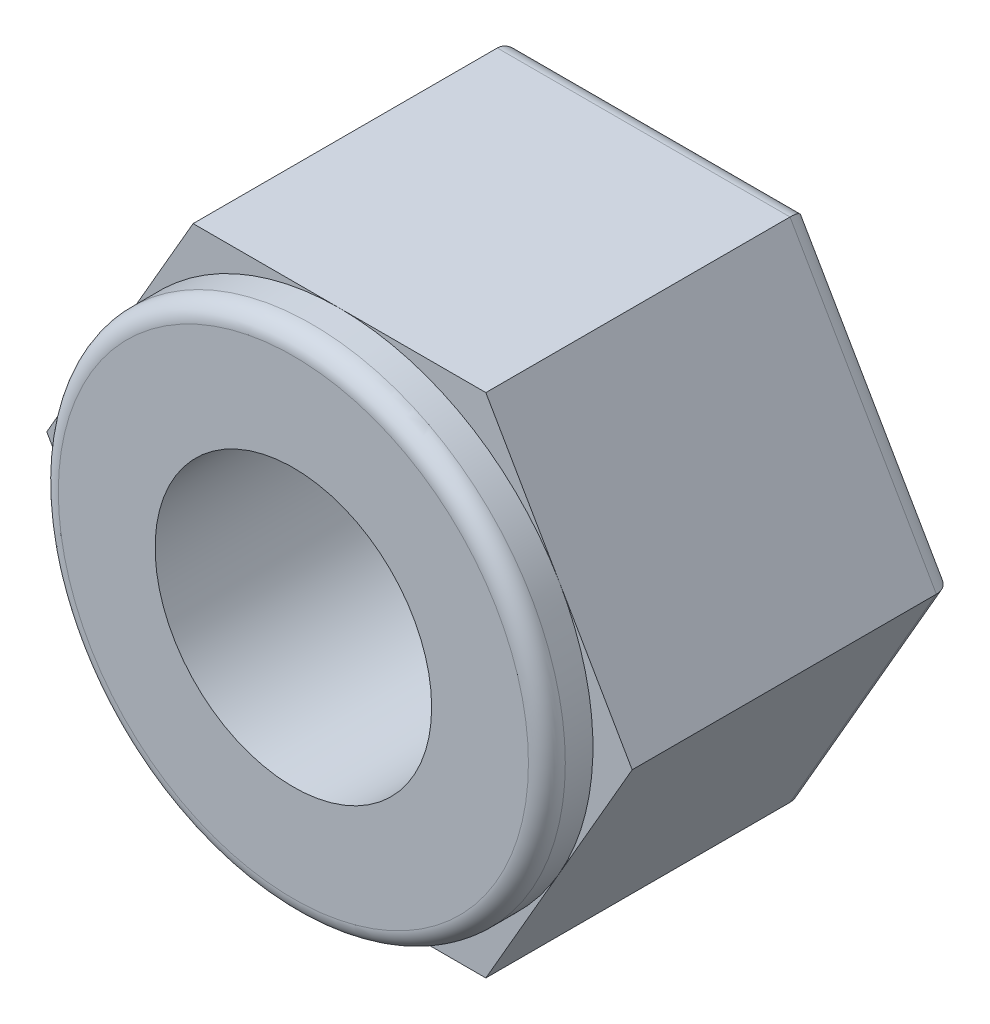
ISO-10303-21;
HEADER;
FILE_DESCRIPTION(('STEP AP214'),'2;1');
FILE_NAME('part.step','',(''),(''),'','','');
FILE_SCHEMA(('AUTOMOTIVE_DESIGN { 1 0 10303 214 1 1 1 1 }'));
ENDSEC;
DATA;
#1=APPLICATION_CONTEXT('core data for automotive mechanical design processes');
#2=APPLICATION_PROTOCOL_DEFINITION('international standard','automotive_design',2000,#1);
#3=PRODUCT_CONTEXT('',#1,'mechanical');
#4=PRODUCT('Part','Part','',(#3));
#5=PRODUCT_RELATED_PRODUCT_CATEGORY('part','',(#4));
#6=PRODUCT_DEFINITION_FORMATION('','',#4);
#7=PRODUCT_DEFINITION_CONTEXT('part definition',#1,'design');
#8=PRODUCT_DEFINITION('design','',#6,#7);
#9=PRODUCT_DEFINITION_SHAPE('','',#8);
#10=(LENGTH_UNIT() NAMED_UNIT(*) SI_UNIT(.MILLI.,.METRE.));
#11=(NAMED_UNIT(*) PLANE_ANGLE_UNIT() SI_UNIT($,.RADIAN.));
#12=(NAMED_UNIT(*) SI_UNIT($,.STERADIAN.) SOLID_ANGLE_UNIT());
#13=UNCERTAINTY_MEASURE_WITH_UNIT(LENGTH_MEASURE(1.E-05),#10,'distance_accuracy_value','');
#14=(GEOMETRIC_REPRESENTATION_CONTEXT(3) GLOBAL_UNCERTAINTY_ASSIGNED_CONTEXT((#13)) GLOBAL_UNIT_ASSIGNED_CONTEXT((#10,
#11,#12)) REPRESENTATION_CONTEXT('',''));
#15=CARTESIAN_POINT('',(0.,0.,0.));
#16=DIRECTION('',(0.,0.,1.));
#17=DIRECTION('',(1.,0.,0.));
#18=AXIS2_PLACEMENT_3D('',#15,#16,#17);
#19=CARTESIAN_POINT('',(0.,0.,3.5));
#20=DIRECTION('',(0.,0.,1.));
#21=DIRECTION('',(1.,0.,0.));
#22=AXIS2_PLACEMENT_3D('',#19,#20,#21);
#23=PLANE('',#22);
#24=CARTESIAN_POINT('',(0.,0.,3.5));
#25=DIRECTION('',(0.,0.,1.));
#26=DIRECTION('',(1.,0.,0.));
#27=AXIS2_PLACEMENT_3D('',#24,#25,#26);
#28=CIRCLE('',#27,2.75);
#29=CARTESIAN_POINT('',(2.38156986040721,1.375,3.5));
#30=VERTEX_POINT('',#29);
#31=CARTESIAN_POINT('',(0.,2.75,3.5));
#32=VERTEX_POINT('',#31);
#33=EDGE_CURVE('E157',#30,#32,#28,.T.);
#34=ORIENTED_EDGE('',*,*,#33,.F.);
#35=DIRECTION('',(-0.5,0.866025403784438,0.));
#36=VECTOR('',#35,1.);
#37=CARTESIAN_POINT('',(3.17542648054294,0.,3.5));
#38=LINE('',#37,#36);
#39=CARTESIAN_POINT('',(1.58771324027147,2.75,3.5));
#40=VERTEX_POINT('',#39);
#41=EDGE_CURVE('E144',#30,#40,#38,.T.);
#42=ORIENTED_EDGE('',*,*,#41,.T.);
#43=DIRECTION('',(-1.,0.,0.));
#44=VECTOR('',#43,1.);
#45=CARTESIAN_POINT('',(1.58771324027147,2.75,3.5));
#46=LINE('',#45,#44);
#47=EDGE_CURVE('E158',#40,#32,#46,.T.);
#48=ORIENTED_EDGE('',*,*,#47,.T.);
#49=EDGE_LOOP('',(#34,#42,#48));
#50=FACE_BOUND('',#49,.T.);
#51=ADVANCED_FACE('F43',(#50),#23,.T.);
#52=CARTESIAN_POINT('',(-2.38156986040721,1.375,3.5));
#53=VERTEX_POINT('',#52);
#54=EDGE_CURVE('E165',#32,#53,#28,.T.);
#55=ORIENTED_EDGE('',*,*,#54,.F.);
#56=CARTESIAN_POINT('',(-1.58771324027147,2.75,3.5));
#57=VERTEX_POINT('',#56);
#58=EDGE_CURVE('E143',#32,#57,#46,.T.);
#59=ORIENTED_EDGE('',*,*,#58,.T.);
#60=DIRECTION('',(-0.5,-0.866025403784439,0.));
#61=VECTOR('',#60,1.);
#62=CARTESIAN_POINT('',(-1.58771324027147,2.75,3.5));
#63=LINE('',#62,#61);
#64=EDGE_CURVE('E187',#57,#53,#63,.T.);
#65=ORIENTED_EDGE('',*,*,#64,.T.);
#66=EDGE_LOOP('',(#55,#59,#65));
#67=FACE_BOUND('',#66,.T.);
#68=ADVANCED_FACE('F305',(#67),#23,.T.);
#69=CARTESIAN_POINT('',(-2.3815698604072,-1.375,3.5));
#70=VERTEX_POINT('',#69);
#71=EDGE_CURVE('E335',#53,#70,#28,.T.);
#72=ORIENTED_EDGE('',*,*,#71,.F.);
#73=CARTESIAN_POINT('',(-3.17542648054294,0.,3.5));
#74=VERTEX_POINT('',#73);
#75=EDGE_CURVE('E186',#53,#74,#63,.T.);
#76=ORIENTED_EDGE('',*,*,#75,.T.);
#77=DIRECTION('',(0.5,-0.866025403784438,0.));
#78=VECTOR('',#77,1.);
#79=CARTESIAN_POINT('',(-3.17542648054294,0.,3.5));
#80=LINE('',#79,#78);
#81=EDGE_CURVE('E192',#74,#70,#80,.T.);
#82=ORIENTED_EDGE('',*,*,#81,.T.);
#83=EDGE_LOOP('',(#72,#76,#82));
#84=FACE_BOUND('',#83,.T.);
#85=ADVANCED_FACE('F310',(#84),#23,.T.);
#86=CARTESIAN_POINT('',(0.,-2.75,3.5));
#87=VERTEX_POINT('',#86);
#88=EDGE_CURVE('E174',#70,#87,#28,.T.);
#89=ORIENTED_EDGE('',*,*,#88,.F.);
#90=CARTESIAN_POINT('',(-1.58771324027147,-2.75,3.5));
#91=VERTEX_POINT('',#90);
#92=EDGE_CURVE('E191',#70,#91,#80,.T.);
#93=ORIENTED_EDGE('',*,*,#92,.T.);
#94=DIRECTION('',(1.,0.,0.));
#95=VECTOR('',#94,1.);
#96=CARTESIAN_POINT('',(-1.58771324027147,-2.75,3.5));
#97=LINE('',#96,#95);
#98=EDGE_CURVE('E197',#91,#87,#97,.T.);
#99=ORIENTED_EDGE('',*,*,#98,.T.);
#100=EDGE_LOOP('',(#89,#93,#99));
#101=FACE_BOUND('',#100,.T.);
#102=ADVANCED_FACE('F322',(#101),#23,.T.);
#103=CARTESIAN_POINT('',(2.38156986040721,-1.375,3.5));
#104=VERTEX_POINT('',#103);
#105=EDGE_CURVE('E169',#87,#104,#28,.T.);
#106=ORIENTED_EDGE('',*,*,#105,.F.);
#107=CARTESIAN_POINT('',(1.58771324027148,-2.75,3.5));
#108=VERTEX_POINT('',#107);
#109=EDGE_CURVE('E196',#87,#108,#97,.T.);
#110=ORIENTED_EDGE('',*,*,#109,.T.);
#111=DIRECTION('',(0.5,0.866025403784439,0.));
#112=VECTOR('',#111,1.);
#113=CARTESIAN_POINT('',(1.58771324027148,-2.75,3.5));
#114=LINE('',#113,#112);
#115=EDGE_CURVE('E155',#108,#104,#114,.T.);
#116=ORIENTED_EDGE('',*,*,#115,.T.);
#117=EDGE_LOOP('',(#106,#110,#116));
#118=FACE_BOUND('',#117,.T.);
#119=ADVANCED_FACE('F315',(#118),#23,.T.);
#120=EDGE_CURVE('E138',#104,#30,#28,.T.);
#121=ORIENTED_EDGE('',*,*,#120,.F.);
#122=CARTESIAN_POINT('',(3.17542648054294,0.,3.5));
#123=VERTEX_POINT('',#122);
#124=EDGE_CURVE('E140',#104,#123,#114,.T.);
#125=ORIENTED_EDGE('',*,*,#124,.T.);
#126=EDGE_CURVE('E134',#123,#30,#38,.T.);
#127=ORIENTED_EDGE('',*,*,#126,.T.);
#128=EDGE_LOOP('',(#121,#125,#127));
#129=FACE_BOUND('',#128,.T.);
#130=ADVANCED_FACE('F136',(#129),#23,.T.);
#131=CARTESIAN_POINT('',(0.,0.,0.));
#132=DIRECTION('',(0.,0.,1.));
#133=DIRECTION('',(1.,0.,0.));
#134=AXIS2_PLACEMENT_3D('',#131,#132,#133);
#135=PLANE('',#134);
#136=DIRECTION('',(1.,0.,0.));
#137=VECTOR('',#136,1.);
#138=CARTESIAN_POINT('',(0.,-2.55,0.));
#139=LINE('',#138,#137);
#140=CARTESIAN_POINT('',(1.47224318643355,-2.55,0.));
#141=VERTEX_POINT('',#140);
#142=CARTESIAN_POINT('',(-1.47224318643354,-2.55,0.));
#143=VERTEX_POINT('',#142);
#144=EDGE_CURVE('E229',#141,#143,#139,.F.);
#145=ORIENTED_EDGE('',*,*,#144,.T.);
#146=DIRECTION('',(0.5,-0.866025403784439,0.));
#147=VECTOR('',#146,1.);
#148=CARTESIAN_POINT('',(-2.20836477965032,-1.275,0.));
#149=LINE('',#148,#147);
#150=CARTESIAN_POINT('',(-2.94448637286709,0.,0.));
#151=VERTEX_POINT('',#150);
#152=EDGE_CURVE('E244',#143,#151,#149,.F.);
#153=ORIENTED_EDGE('',*,*,#152,.T.);
#154=DIRECTION('',(-0.5,-0.866025403784439,0.));
#155=VECTOR('',#154,1.);
#156=CARTESIAN_POINT('',(-2.20836477965032,1.275,0.));
#157=LINE('',#156,#155);
#158=CARTESIAN_POINT('',(-1.47224318643355,2.55,0.));
#159=VERTEX_POINT('',#158);
#160=EDGE_CURVE('E241',#151,#159,#157,.F.);
#161=ORIENTED_EDGE('',*,*,#160,.T.);
#162=DIRECTION('',(-1.,0.,0.));
#163=VECTOR('',#162,1.);
#164=CARTESIAN_POINT('',(0.,2.55,0.));
#165=LINE('',#164,#163);
#166=CARTESIAN_POINT('',(1.47224318643355,2.55,0.));
#167=VERTEX_POINT('',#166);
#168=EDGE_CURVE('E238',#159,#167,#165,.F.);
#169=ORIENTED_EDGE('',*,*,#168,.T.);
#170=DIRECTION('',(-0.5,0.866025403784439,0.));
#171=VECTOR('',#170,1.);
#172=CARTESIAN_POINT('',(2.20836477965032,1.275,0.));
#173=LINE('',#172,#171);
#174=CARTESIAN_POINT('',(2.94448637286709,0.,0.));
#175=VERTEX_POINT('',#174);
#176=EDGE_CURVE('E235',#167,#175,#173,.F.);
#177=ORIENTED_EDGE('',*,*,#176,.T.);
#178=DIRECTION('',(0.5,0.866025403784439,0.));
#179=VECTOR('',#178,1.);
#180=CARTESIAN_POINT('',(2.20836477965032,-1.275,0.));
#181=LINE('',#180,#179);
#182=EDGE_CURVE('E232',#175,#141,#181,.F.);
#183=ORIENTED_EDGE('',*,*,#182,.T.);
#184=EDGE_LOOP('',(#145,#153,#161,#169,#177,#183));
#185=FACE_BOUND('',#184,.T.);
#186=CARTESIAN_POINT('',(0.,0.,0.));
#187=DIRECTION('',(0.,0.,1.));
#188=DIRECTION('',(1.,0.,0.));
#189=AXIS2_PLACEMENT_3D('',#186,#187,#188);
#190=CIRCLE('',#189,1.5);
#191=CARTESIAN_POINT('',(1.5,0.,0.));
#192=VERTEX_POINT('',#191);
#193=EDGE_CURVE('E162',#192,#192,#190,.T.);
#194=ORIENTED_EDGE('',*,*,#193,.T.);
#195=EDGE_LOOP('',(#194));
#196=FACE_BOUND('',#195,.T.);
#197=ADVANCED_FACE('F314',(#185,#196),#135,.F.);
#198=CARTESIAN_POINT('',(1.58771324027148,-2.75,3.5));
#199=DIRECTION('',(-0.866025403784439,0.5,0.));
#200=DIRECTION('',(-0.5,-0.866025403784439,0.));
#201=AXIS2_PLACEMENT_3D('',#198,#199,#200);
#202=PLANE('',#201);
#203=DIRECTION('',(0.,0.,-1.));
#204=VECTOR('',#203,1.);
#205=CARTESIAN_POINT('',(1.58771324027148,-2.75,3.5));
#206=LINE('',#205,#204);
#207=CARTESIAN_POINT('',(1.58771324027148,-2.75,0.2));
#208=VERTEX_POINT('',#207);
#209=EDGE_CURVE('E201',#108,#208,#206,.T.);
#210=ORIENTED_EDGE('',*,*,#209,.T.);
#211=DIRECTION('',(0.5,0.866025403784439,0.));
#212=VECTOR('',#211,1.);
#213=CARTESIAN_POINT('',(1.58771324027148,-2.75,0.2));
#214=LINE('',#213,#212);
#215=CARTESIAN_POINT('',(3.17542648054294,0.,0.2));
#216=VERTEX_POINT('',#215);
#217=EDGE_CURVE('E53',#208,#216,#214,.T.);
#218=ORIENTED_EDGE('',*,*,#217,.T.);
#219=DIRECTION('',(0.,0.,-1.));
#220=VECTOR('',#219,1.);
#221=CARTESIAN_POINT('',(3.17542648054294,0.,3.5));
#222=LINE('',#221,#220);
#223=EDGE_CURVE('E171',#123,#216,#222,.T.);
#224=ORIENTED_EDGE('',*,*,#223,.F.);
#225=ORIENTED_EDGE('',*,*,#124,.F.);
#226=ORIENTED_EDGE('',*,*,#115,.F.);
#227=EDGE_LOOP('',(#210,#218,#224,#225,#226));
#228=FACE_BOUND('',#227,.T.);
#229=ADVANCED_FACE('F320',(#228),#202,.F.);
#230=CARTESIAN_POINT('',(3.17542648054294,0.,3.5));
#231=DIRECTION('',(-0.866025403784438,-0.5,0.));
#232=DIRECTION('',(0.5,-0.866025403784439,0.));
#233=AXIS2_PLACEMENT_3D('',#230,#231,#232);
#234=PLANE('',#233);
#235=ORIENTED_EDGE('',*,*,#223,.T.);
#236=DIRECTION('',(-0.5,0.866025403784439,0.));
#237=VECTOR('',#236,1.);
#238=CARTESIAN_POINT('',(3.17542648054294,0.,0.2));
#239=LINE('',#238,#237);
#240=CARTESIAN_POINT('',(1.58771324027147,2.75,0.2));
#241=VERTEX_POINT('',#240);
#242=EDGE_CURVE('E254',#216,#241,#239,.T.);
#243=ORIENTED_EDGE('',*,*,#242,.T.);
#244=DIRECTION('',(0.,0.,-1.));
#245=VECTOR('',#244,1.);
#246=CARTESIAN_POINT('',(1.58771324027147,2.75,3.5));
#247=LINE('',#246,#245);
#248=EDGE_CURVE('E150',#40,#241,#247,.T.);
#249=ORIENTED_EDGE('',*,*,#248,.F.);
#250=ORIENTED_EDGE('',*,*,#41,.F.);
#251=ORIENTED_EDGE('',*,*,#126,.F.);
#252=EDGE_LOOP('',(#235,#243,#249,#250,#251));
#253=FACE_BOUND('',#252,.T.);
#254=ADVANCED_FACE('F148',(#253),#234,.F.);
#255=CARTESIAN_POINT('',(1.58771324027147,2.75,3.5));
#256=DIRECTION('',(0.,-1.,0.));
#257=DIRECTION('',(0.,0.,-1.));
#258=AXIS2_PLACEMENT_3D('',#255,#256,#257);
#259=PLANE('',#258);
#260=ORIENTED_EDGE('',*,*,#248,.T.);
#261=DIRECTION('',(-1.,0.,0.));
#262=VECTOR('',#261,1.);
#263=CARTESIAN_POINT('',(1.58771324027147,2.75,0.2));
#264=LINE('',#263,#262);
#265=CARTESIAN_POINT('',(-1.58771324027147,2.75,0.2));
#266=VERTEX_POINT('',#265);
#267=EDGE_CURVE('E251',#241,#266,#264,.T.);
#268=ORIENTED_EDGE('',*,*,#267,.T.);
#269=DIRECTION('',(0.,0.,-1.));
#270=VECTOR('',#269,1.);
#271=CARTESIAN_POINT('',(-1.58771324027147,2.75,3.5));
#272=LINE('',#271,#270);
#273=EDGE_CURVE('E211',#57,#266,#272,.T.);
#274=ORIENTED_EDGE('',*,*,#273,.F.);
#275=ORIENTED_EDGE('',*,*,#58,.F.);
#276=ORIENTED_EDGE('',*,*,#47,.F.);
#277=EDGE_LOOP('',(#260,#268,#274,#275,#276));
#278=FACE_BOUND('',#277,.T.);
#279=ADVANCED_FACE('F343',(#278),#259,.F.);
#280=CARTESIAN_POINT('',(-1.58771324027147,2.75,3.5));
#281=DIRECTION('',(0.866025403784439,-0.5,0.));
#282=DIRECTION('',(0.5,0.866025403784439,0.));
#283=AXIS2_PLACEMENT_3D('',#280,#281,#282);
#284=PLANE('',#283);
#285=ORIENTED_EDGE('',*,*,#273,.T.);
#286=DIRECTION('',(-0.5,-0.866025403784439,0.));
#287=VECTOR('',#286,1.);
#288=CARTESIAN_POINT('',(-1.58771324027147,2.75,0.2));
#289=LINE('',#288,#287);
#290=CARTESIAN_POINT('',(-3.17542648054294,0.,0.2));
#291=VERTEX_POINT('',#290);
#292=EDGE_CURVE('E248',#266,#291,#289,.T.);
#293=ORIENTED_EDGE('',*,*,#292,.T.);
#294=DIRECTION('',(0.,0.,-1.));
#295=VECTOR('',#294,1.);
#296=CARTESIAN_POINT('',(-3.17542648054294,0.,3.5));
#297=LINE('',#296,#295);
#298=EDGE_CURVE('E207',#74,#291,#297,.T.);
#299=ORIENTED_EDGE('',*,*,#298,.F.);
#300=ORIENTED_EDGE('',*,*,#75,.F.);
#301=ORIENTED_EDGE('',*,*,#64,.F.);
#302=EDGE_LOOP('',(#285,#293,#299,#300,#301));
#303=FACE_BOUND('',#302,.T.);
#304=ADVANCED_FACE('F353',(#303),#284,.F.);
#305=CARTESIAN_POINT('',(-3.17542648054294,0.,3.5));
#306=DIRECTION('',(0.866025403784438,0.5,0.));
#307=DIRECTION('',(-0.5,0.866025403784439,0.));
#308=AXIS2_PLACEMENT_3D('',#305,#306,#307);
#309=PLANE('',#308);
#310=ORIENTED_EDGE('',*,*,#298,.T.);
#311=DIRECTION('',(0.5,-0.866025403784439,0.));
#312=VECTOR('',#311,1.);
#313=CARTESIAN_POINT('',(-3.17542648054294,0.,0.2));
#314=LINE('',#313,#312);
#315=CARTESIAN_POINT('',(-1.58771324027147,-2.75,0.2));
#316=VERTEX_POINT('',#315);
#317=EDGE_CURVE('E225',#291,#316,#314,.T.);
#318=ORIENTED_EDGE('',*,*,#317,.T.);
#319=DIRECTION('',(0.,0.,-1.));
#320=VECTOR('',#319,1.);
#321=CARTESIAN_POINT('',(-1.58771324027147,-2.75,3.5));
#322=LINE('',#321,#320);
#323=EDGE_CURVE('E204',#91,#316,#322,.T.);
#324=ORIENTED_EDGE('',*,*,#323,.F.);
#325=ORIENTED_EDGE('',*,*,#92,.F.);
#326=ORIENTED_EDGE('',*,*,#81,.F.);
#327=EDGE_LOOP('',(#310,#318,#324,#325,#326));
#328=FACE_BOUND('',#327,.T.);
#329=ADVANCED_FACE('F357',(#328),#309,.F.);
#330=CARTESIAN_POINT('',(-1.58771324027147,-2.75,3.5));
#331=DIRECTION('',(0.,1.,0.));
#332=DIRECTION('',(0.,0.,1.));
#333=AXIS2_PLACEMENT_3D('',#330,#331,#332);
#334=PLANE('',#333);
#335=ORIENTED_EDGE('',*,*,#323,.T.);
#336=DIRECTION('',(1.,0.,0.));
#337=VECTOR('',#336,1.);
#338=CARTESIAN_POINT('',(-1.58771324027147,-2.75,0.2));
#339=LINE('',#338,#337);
#340=EDGE_CURVE('E11',#316,#208,#339,.T.);
#341=ORIENTED_EDGE('',*,*,#340,.T.);
#342=ORIENTED_EDGE('',*,*,#209,.F.);
#343=ORIENTED_EDGE('',*,*,#109,.F.);
#344=ORIENTED_EDGE('',*,*,#98,.F.);
#345=EDGE_LOOP('',(#335,#341,#342,#343,#344));
#346=FACE_BOUND('',#345,.T.);
#347=ADVANCED_FACE('F301',(#346),#334,.F.);
#348=CARTESIAN_POINT('',(0.,0.,3.5));
#349=DIRECTION('',(0.,0.,-1.));
#350=DIRECTION('',(-1.,0.,0.));
#351=AXIS2_PLACEMENT_3D('',#348,#349,#350);
#352=CYLINDRICAL_SURFACE('',#351,1.5);
#353=ORIENTED_EDGE('',*,*,#193,.F.);
#354=EDGE_LOOP('',(#353));
#355=FACE_BOUND('',#354,.T.);
#356=CARTESIAN_POINT('',(0.,0.,4.));
#357=DIRECTION('',(0.,0.,1.));
#358=DIRECTION('',(1.,0.,0.));
#359=AXIS2_PLACEMENT_3D('',#356,#357,#358);
#360=CIRCLE('',#359,1.5);
#361=CARTESIAN_POINT('',(1.5,0.,4.));
#362=VERTEX_POINT('',#361);
#363=EDGE_CURVE('E163',#362,#362,#360,.T.);
#364=ORIENTED_EDGE('',*,*,#363,.T.);
#365=EDGE_LOOP('',(#364));
#366=FACE_BOUND('',#365,.T.);
#367=ADVANCED_FACE('F288',(#355,#366),#352,.F.);
#368=CARTESIAN_POINT('',(0.,0.,4.));
#369=DIRECTION('',(0.,0.,1.));
#370=DIRECTION('',(1.,0.,0.));
#371=AXIS2_PLACEMENT_3D('',#368,#369,#370);
#372=PLANE('',#371);
#373=CARTESIAN_POINT('',(0.,0.,4.));
#374=DIRECTION('',(0.,0.,1.));
#375=DIRECTION('',(1.,0.,0.));
#376=AXIS2_PLACEMENT_3D('',#373,#374,#375);
#377=CIRCLE('',#376,2.55);
#378=CARTESIAN_POINT('',(2.55,0.,4.));
#379=VERTEX_POINT('',#378);
#380=EDGE_CURVE('E217',#379,#379,#377,.T.);
#381=ORIENTED_EDGE('',*,*,#380,.T.);
#382=EDGE_LOOP('',(#381));
#383=FACE_BOUND('',#382,.T.);
#384=ORIENTED_EDGE('',*,*,#363,.F.);
#385=EDGE_LOOP('',(#384));
#386=FACE_BOUND('',#385,.T.);
#387=ADVANCED_FACE('F290',(#383,#386),#372,.T.);
#388=CARTESIAN_POINT('',(0.,0.,4.));
#389=DIRECTION('',(0.,0.,-1.));
#390=DIRECTION('',(-1.,0.,0.));
#391=AXIS2_PLACEMENT_3D('',#388,#389,#390);
#392=CYLINDRICAL_SURFACE('',#391,2.75);
#393=CARTESIAN_POINT('',(0.,0.,3.8));
#394=DIRECTION('',(0.,0.,1.));
#395=DIRECTION('',(1.,0.,0.));
#396=AXIS2_PLACEMENT_3D('',#393,#394,#395);
#397=CIRCLE('',#396,2.75);
#398=CARTESIAN_POINT('',(2.75,0.,3.8));
#399=VERTEX_POINT('',#398);
#400=EDGE_CURVE('E221',#399,#399,#397,.F.);
#401=ORIENTED_EDGE('',*,*,#400,.T.);
#402=EDGE_LOOP('',(#401));
#403=FACE_BOUND('',#402,.T.);
#404=ORIENTED_EDGE('',*,*,#33,.T.);
#405=ORIENTED_EDGE('',*,*,#54,.T.);
#406=ORIENTED_EDGE('',*,*,#71,.T.);
#407=ORIENTED_EDGE('',*,*,#88,.T.);
#408=ORIENTED_EDGE('',*,*,#105,.T.);
#409=ORIENTED_EDGE('',*,*,#120,.T.);
#410=EDGE_LOOP('',(#404,#405,#406,#407,#408,#409));
#411=FACE_BOUND('',#410,.T.);
#412=ADVANCED_FACE('F167',(#403,#411),#392,.T.);
#413=CARTESIAN_POINT('',(0.,0.,3.8));
#414=DIRECTION('',(0.,0.,1.));
#415=DIRECTION('',(1.,0.,0.));
#416=AXIS2_PLACEMENT_3D('',#413,#414,#415);
#417=TOROIDAL_SURFACE('',#416,2.55,0.2);
#418=ORIENTED_EDGE('',*,*,#400,.F.);
#419=EDGE_LOOP('',(#418));
#420=FACE_BOUND('',#419,.T.);
#421=ORIENTED_EDGE('',*,*,#380,.F.);
#422=EDGE_LOOP('',(#421));
#423=FACE_BOUND('',#422,.T.);
#424=ADVANCED_FACE('F298',(#420,#423),#417,.T.);
#425=CARTESIAN_POINT('',(3.00222139978606,-0.100000000000002,0.2));
#426=DIRECTION('',(-0.5,0.866025403784439,0.));
#427=DIRECTION('',(-0.866025403784439,-0.5,0.));
#428=AXIS2_PLACEMENT_3D('',#425,#426,#427);
#429=CYLINDRICAL_SURFACE('',#428,0.2);
#430=CARTESIAN_POINT('',(2.94448637286709,0.,0.2));
#431=DIRECTION('',(0.,1.,0.));
#432=DIRECTION('',(1.,0.,0.));
#433=AXIS2_PLACEMENT_3D('',#430,#431,#432);
#434=ELLIPSE('',#433,0.23094010767585,0.2);
#435=EDGE_CURVE('E272',#175,#216,#434,.F.);
#436=ORIENTED_EDGE('',*,*,#435,.F.);
#437=ORIENTED_EDGE('',*,*,#176,.F.);
#438=CARTESIAN_POINT('',(1.47224318643355,2.55,0.2));
#439=DIRECTION('',(-0.866025403784439,0.5,0.));
#440=DIRECTION('',(0.5,0.866025403784439,0.));
#441=AXIS2_PLACEMENT_3D('',#438,#439,#440);
#442=ELLIPSE('',#441,0.23094010767585,0.2);
#443=EDGE_CURVE('E47',#241,#167,#442,.T.);
#444=ORIENTED_EDGE('',*,*,#443,.F.);
#445=ORIENTED_EDGE('',*,*,#242,.F.);
#446=EDGE_LOOP('',(#436,#437,#444,#445));
#447=FACE_BOUND('',#446,.T.);
#448=ADVANCED_FACE('F45',(#447),#429,.T.);
#449=CARTESIAN_POINT('',(1.58771324027147,2.55,0.2));
#450=DIRECTION('',(-1.,0.,0.));
#451=DIRECTION('',(0.,0.,1.));
#452=AXIS2_PLACEMENT_3D('',#449,#450,#451);
#453=CYLINDRICAL_SURFACE('',#452,0.2);
#454=ORIENTED_EDGE('',*,*,#443,.T.);
#455=ORIENTED_EDGE('',*,*,#168,.F.);
#456=CARTESIAN_POINT('',(-1.47224318643354,2.55,0.2));
#457=DIRECTION('',(-0.866025403784439,-0.5,0.));
#458=DIRECTION('',(-0.5,0.866025403784439,0.));
#459=AXIS2_PLACEMENT_3D('',#456,#457,#458);
#460=ELLIPSE('',#459,0.23094010767585,0.2);
#461=EDGE_CURVE('E269',#266,#159,#460,.T.);
#462=ORIENTED_EDGE('',*,*,#461,.F.);
#463=ORIENTED_EDGE('',*,*,#267,.F.);
#464=EDGE_LOOP('',(#454,#455,#462,#463));
#465=FACE_BOUND('',#464,.T.);
#466=ADVANCED_FACE('F374',(#465),#453,.T.);
#467=CARTESIAN_POINT('',(1.41450815951459,-2.65,0.2));
#468=DIRECTION('',(0.5,0.866025403784439,0.));
#469=DIRECTION('',(-0.866025403784439,0.5,0.));
#470=AXIS2_PLACEMENT_3D('',#467,#468,#469);
#471=CYLINDRICAL_SURFACE('',#470,0.2);
#472=ORIENTED_EDGE('',*,*,#435,.T.);
#473=ORIENTED_EDGE('',*,*,#217,.F.);
#474=CARTESIAN_POINT('',(1.47224318643355,-2.55,0.2));
#475=DIRECTION('',(0.866025403784439,0.5,0.));
#476=DIRECTION('',(0.5,-0.866025403784439,0.));
#477=AXIS2_PLACEMENT_3D('',#474,#475,#476);
#478=ELLIPSE('',#477,0.23094010767585,0.2);
#479=EDGE_CURVE('E265',#141,#208,#478,.F.);
#480=ORIENTED_EDGE('',*,*,#479,.F.);
#481=ORIENTED_EDGE('',*,*,#182,.F.);
#482=EDGE_LOOP('',(#472,#473,#480,#481));
#483=FACE_BOUND('',#482,.T.);
#484=ADVANCED_FACE('F368',(#483),#471,.T.);
#485=CARTESIAN_POINT('',(-1.41450815951458,2.65,0.2));
#486=DIRECTION('',(-0.5,-0.866025403784439,0.));
#487=DIRECTION('',(0.866025403784439,-0.5,0.));
#488=AXIS2_PLACEMENT_3D('',#485,#486,#487);
#489=CYLINDRICAL_SURFACE('',#488,0.2);
#490=ORIENTED_EDGE('',*,*,#461,.T.);
#491=ORIENTED_EDGE('',*,*,#160,.F.);
#492=CARTESIAN_POINT('',(-2.94448637286709,0.,0.2));
#493=DIRECTION('',(0.,-1.,0.));
#494=DIRECTION('',(-1.,0.,0.));
#495=AXIS2_PLACEMENT_3D('',#492,#493,#494);
#496=ELLIPSE('',#495,0.23094010767585,0.2);
#497=EDGE_CURVE('E262',#291,#151,#496,.T.);
#498=ORIENTED_EDGE('',*,*,#497,.F.);
#499=ORIENTED_EDGE('',*,*,#292,.F.);
#500=EDGE_LOOP('',(#490,#491,#498,#499));
#501=FACE_BOUND('',#500,.T.);
#502=ADVANCED_FACE('F376',(#501),#489,.T.);
#503=CARTESIAN_POINT('',(-1.58771324027147,-2.55,0.2));
#504=DIRECTION('',(1.,0.,0.));
#505=DIRECTION('',(0.,0.,-1.));
#506=AXIS2_PLACEMENT_3D('',#503,#504,#505);
#507=CYLINDRICAL_SURFACE('',#506,0.2);
#508=ORIENTED_EDGE('',*,*,#479,.T.);
#509=ORIENTED_EDGE('',*,*,#340,.F.);
#510=CARTESIAN_POINT('',(-1.47224318643354,-2.55,0.2));
#511=DIRECTION('',(0.866025403784439,-0.5,0.));
#512=DIRECTION('',(0.5,0.866025403784439,0.));
#513=AXIS2_PLACEMENT_3D('',#510,#511,#512);
#514=ELLIPSE('',#513,0.23094010767585,0.2);
#515=EDGE_CURVE('E259',#143,#316,#514,.F.);
#516=ORIENTED_EDGE('',*,*,#515,.F.);
#517=ORIENTED_EDGE('',*,*,#144,.F.);
#518=EDGE_LOOP('',(#508,#509,#516,#517));
#519=FACE_BOUND('',#518,.T.);
#520=ADVANCED_FACE('F366',(#519),#507,.T.);
#521=CARTESIAN_POINT('',(-3.00222139978605,0.1,0.2));
#522=DIRECTION('',(0.5,-0.866025403784439,0.));
#523=DIRECTION('',(0.866025403784438,0.5,0.));
#524=AXIS2_PLACEMENT_3D('',#521,#522,#523);
#525=CYLINDRICAL_SURFACE('',#524,0.2);
#526=ORIENTED_EDGE('',*,*,#497,.T.);
#527=ORIENTED_EDGE('',*,*,#152,.F.);
#528=ORIENTED_EDGE('',*,*,#515,.T.);
#529=ORIENTED_EDGE('',*,*,#317,.F.);
#530=EDGE_LOOP('',(#526,#527,#528,#529));
#531=FACE_BOUND('',#530,.T.);
#532=ADVANCED_FACE('F360',(#531),#525,.T.);
#533=CLOSED_SHELL('',(#51,#68,#85,#102,#119,#130,#197,#229,#254,#279,#304,#329,#347,#367,#387,
#412,#424,#448,#466,#484,#502,#520,#532));
#534=MANIFOLD_SOLID_BREP('B2',#533);
#535=ADVANCED_BREP_SHAPE_REPRESENTATION('',(#18,#534),#14);
#536=SHAPE_DEFINITION_REPRESENTATION(#9,#535);
ENDSEC;
END-ISO-10303-21;
